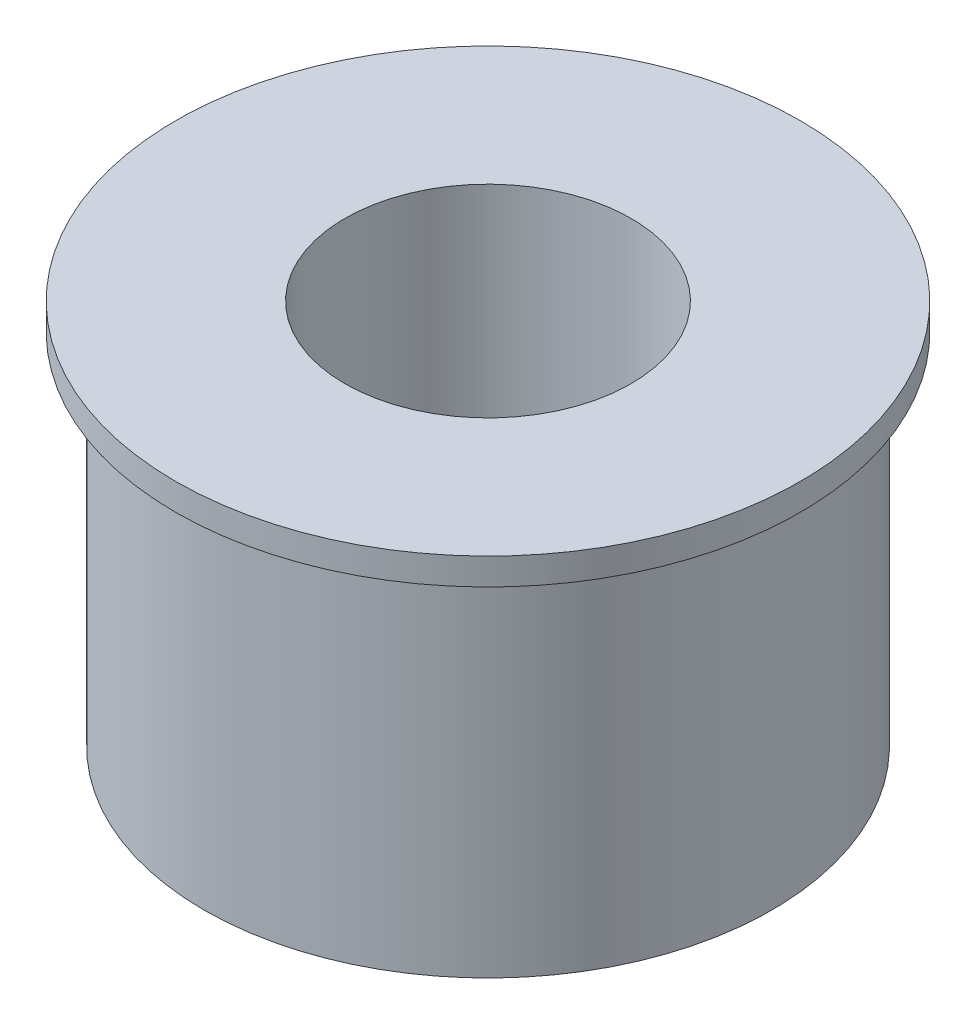
ISO-10303-21;
HEADER;
FILE_DESCRIPTION(('STEP AP214'),'2;1');
FILE_NAME('part.step','',(''),(''),'','','');
FILE_SCHEMA(('AUTOMOTIVE_DESIGN { 1 0 10303 214 1 1 1 1 }'));
ENDSEC;
DATA;
#1=APPLICATION_CONTEXT('core data for automotive mechanical design processes');
#2=APPLICATION_PROTOCOL_DEFINITION('international standard','automotive_design',2000,#1);
#3=PRODUCT_CONTEXT('',#1,'mechanical');
#4=PRODUCT('Part','Part','',(#3));
#5=PRODUCT_RELATED_PRODUCT_CATEGORY('part','',(#4));
#6=PRODUCT_DEFINITION_FORMATION('','',#4);
#7=PRODUCT_DEFINITION_CONTEXT('part definition',#1,'design');
#8=PRODUCT_DEFINITION('design','',#6,#7);
#9=PRODUCT_DEFINITION_SHAPE('','',#8);
#10=(LENGTH_UNIT() NAMED_UNIT(*) SI_UNIT(.MILLI.,.METRE.));
#11=(NAMED_UNIT(*) PLANE_ANGLE_UNIT() SI_UNIT($,.RADIAN.));
#12=(NAMED_UNIT(*) SI_UNIT($,.STERADIAN.) SOLID_ANGLE_UNIT());
#13=UNCERTAINTY_MEASURE_WITH_UNIT(LENGTH_MEASURE(1.E-05),#10,'distance_accuracy_value','');
#14=(GEOMETRIC_REPRESENTATION_CONTEXT(3) GLOBAL_UNCERTAINTY_ASSIGNED_CONTEXT((#13)) GLOBAL_UNIT_ASSIGNED_CONTEXT((#10,
#11,#12)) REPRESENTATION_CONTEXT('',''));
#15=CARTESIAN_POINT('',(0.,0.,0.));
#16=DIRECTION('',(0.,0.,1.));
#17=DIRECTION('',(1.,0.,0.));
#18=AXIS2_PLACEMENT_3D('',#15,#16,#17);
#19=CARTESIAN_POINT('',(0.,10.8,0.));
#20=DIRECTION('',(0.,-1.,0.));
#21=DIRECTION('',(0.,0.,-1.));
#22=AXIS2_PLACEMENT_3D('',#19,#20,#21);
#23=CYLINDRICAL_SURFACE('',#22,7.95);
#24=CARTESIAN_POINT('',(0.,0.,0.));
#25=DIRECTION('',(0.,1.,0.));
#26=DIRECTION('',(0.,0.,1.));
#27=AXIS2_PLACEMENT_3D('',#24,#25,#26);
#28=CIRCLE('',#27,7.95);
#29=CARTESIAN_POINT('',(0.,0.,7.95));
#30=VERTEX_POINT('',#29);
#31=EDGE_CURVE('E34',#30,#30,#28,.T.);
#32=ORIENTED_EDGE('',*,*,#31,.T.);
#33=EDGE_LOOP('',(#32));
#34=FACE_BOUND('',#33,.T.);
#35=CARTESIAN_POINT('',(0.,10.05,0.));
#36=DIRECTION('',(0.,1.,0.));
#37=DIRECTION('',(0.,0.,1.));
#38=AXIS2_PLACEMENT_3D('',#35,#36,#37);
#39=CIRCLE('',#38,7.95);
#40=CARTESIAN_POINT('',(0.,10.05,7.95));
#41=VERTEX_POINT('',#40);
#42=EDGE_CURVE('E10',#41,#41,#39,.T.);
#43=ORIENTED_EDGE('',*,*,#42,.F.);
#44=EDGE_LOOP('',(#43));
#45=FACE_BOUND('',#44,.T.);
#46=ADVANCED_FACE('F28',(#34,#45),#23,.T.);
#47=CARTESIAN_POINT('',(0.,10.8,0.));
#48=DIRECTION('',(0.,1.,0.));
#49=DIRECTION('',(0.,0.,1.));
#50=AXIS2_PLACEMENT_3D('',#47,#48,#49);
#51=PLANE('',#50);
#52=CARTESIAN_POINT('',(0.,10.8,0.));
#53=DIRECTION('',(0.,1.,0.));
#54=DIRECTION('',(0.,0.,1.));
#55=AXIS2_PLACEMENT_3D('',#52,#53,#54);
#56=CIRCLE('',#55,8.75);
#57=CARTESIAN_POINT('',(0.,10.8,8.75));
#58=VERTEX_POINT('',#57);
#59=EDGE_CURVE('E48',#58,#58,#56,.T.);
#60=ORIENTED_EDGE('',*,*,#59,.T.);
#61=EDGE_LOOP('',(#60));
#62=FACE_BOUND('',#61,.T.);
#63=CARTESIAN_POINT('',(0.,10.8,0.));
#64=DIRECTION('',(0.,1.,0.));
#65=DIRECTION('',(0.,0.,1.));
#66=AXIS2_PLACEMENT_3D('',#63,#64,#65);
#67=CIRCLE('',#66,4.01);
#68=CARTESIAN_POINT('',(0.,10.8,4.01));
#69=VERTEX_POINT('',#68);
#70=EDGE_CURVE('E38',#69,#69,#67,.T.);
#71=ORIENTED_EDGE('',*,*,#70,.F.);
#72=EDGE_LOOP('',(#71));
#73=FACE_BOUND('',#72,.T.);
#74=ADVANCED_FACE('F70',(#62,#73),#51,.T.);
#75=CARTESIAN_POINT('',(0.,0.,0.));
#76=DIRECTION('',(0.,1.,0.));
#77=DIRECTION('',(0.,0.,1.));
#78=AXIS2_PLACEMENT_3D('',#75,#76,#77);
#79=PLANE('',#78);
#80=ORIENTED_EDGE('',*,*,#31,.F.);
#81=EDGE_LOOP('',(#80));
#82=FACE_BOUND('',#81,.T.);
#83=CARTESIAN_POINT('',(0.,0.,0.));
#84=DIRECTION('',(0.,1.,0.));
#85=DIRECTION('',(0.,0.,1.));
#86=AXIS2_PLACEMENT_3D('',#83,#84,#85);
#87=CIRCLE('',#86,4.01);
#88=CARTESIAN_POINT('',(0.,0.,4.01));
#89=VERTEX_POINT('',#88);
#90=EDGE_CURVE('E42',#89,#89,#87,.T.);
#91=ORIENTED_EDGE('',*,*,#90,.T.);
#92=EDGE_LOOP('',(#91));
#93=FACE_BOUND('',#92,.T.);
#94=ADVANCED_FACE('F66',(#82,#93),#79,.F.);
#95=CARTESIAN_POINT('',(0.,10.8,0.));
#96=DIRECTION('',(0.,-1.,0.));
#97=DIRECTION('',(0.,0.,-1.));
#98=AXIS2_PLACEMENT_3D('',#95,#96,#97);
#99=CYLINDRICAL_SURFACE('',#98,4.01);
#100=ORIENTED_EDGE('',*,*,#70,.T.);
#101=EDGE_LOOP('',(#100));
#102=FACE_BOUND('',#101,.T.);
#103=ORIENTED_EDGE('',*,*,#90,.F.);
#104=EDGE_LOOP('',(#103));
#105=FACE_BOUND('',#104,.T.);
#106=ADVANCED_FACE('F59',(#102,#105),#99,.F.);
#107=CARTESIAN_POINT('',(0.,10.05,0.));
#108=DIRECTION('',(0.,1.,0.));
#109=DIRECTION('',(0.,0.,1.));
#110=AXIS2_PLACEMENT_3D('',#107,#108,#109);
#111=PLANE('',#110);
#112=CARTESIAN_POINT('',(0.,10.05,0.));
#113=DIRECTION('',(0.,1.,0.));
#114=DIRECTION('',(0.,0.,1.));
#115=AXIS2_PLACEMENT_3D('',#112,#113,#114);
#116=CIRCLE('',#115,8.75);
#117=CARTESIAN_POINT('',(0.,10.05,8.75));
#118=VERTEX_POINT('',#117);
#119=EDGE_CURVE('E46',#118,#118,#116,.T.);
#120=ORIENTED_EDGE('',*,*,#119,.F.);
#121=EDGE_LOOP('',(#120));
#122=FACE_BOUND('',#121,.T.);
#123=ORIENTED_EDGE('',*,*,#42,.T.);
#124=EDGE_LOOP('',(#123));
#125=FACE_BOUND('',#124,.T.);
#126=ADVANCED_FACE('F57',(#122,#125),#111,.F.);
#127=CARTESIAN_POINT('',(0.,10.05,0.));
#128=DIRECTION('',(0.,1.,0.));
#129=DIRECTION('',(0.,0.,1.));
#130=AXIS2_PLACEMENT_3D('',#127,#128,#129);
#131=CYLINDRICAL_SURFACE('',#130,8.75);
#132=ORIENTED_EDGE('',*,*,#119,.T.);
#133=EDGE_LOOP('',(#132));
#134=FACE_BOUND('',#133,.T.);
#135=ORIENTED_EDGE('',*,*,#59,.F.);
#136=EDGE_LOOP('',(#135));
#137=FACE_BOUND('',#136,.T.);
#138=ADVANCED_FACE('F54',(#134,#137),#131,.T.);
#139=CLOSED_SHELL('',(#46,#74,#94,#106,#126,#138));
#140=MANIFOLD_SOLID_BREP('B2',#139);
#141=ADVANCED_BREP_SHAPE_REPRESENTATION('',(#18,#140),#14);
#142=SHAPE_DEFINITION_REPRESENTATION(#9,#141);
ENDSEC;
END-ISO-10303-21;
